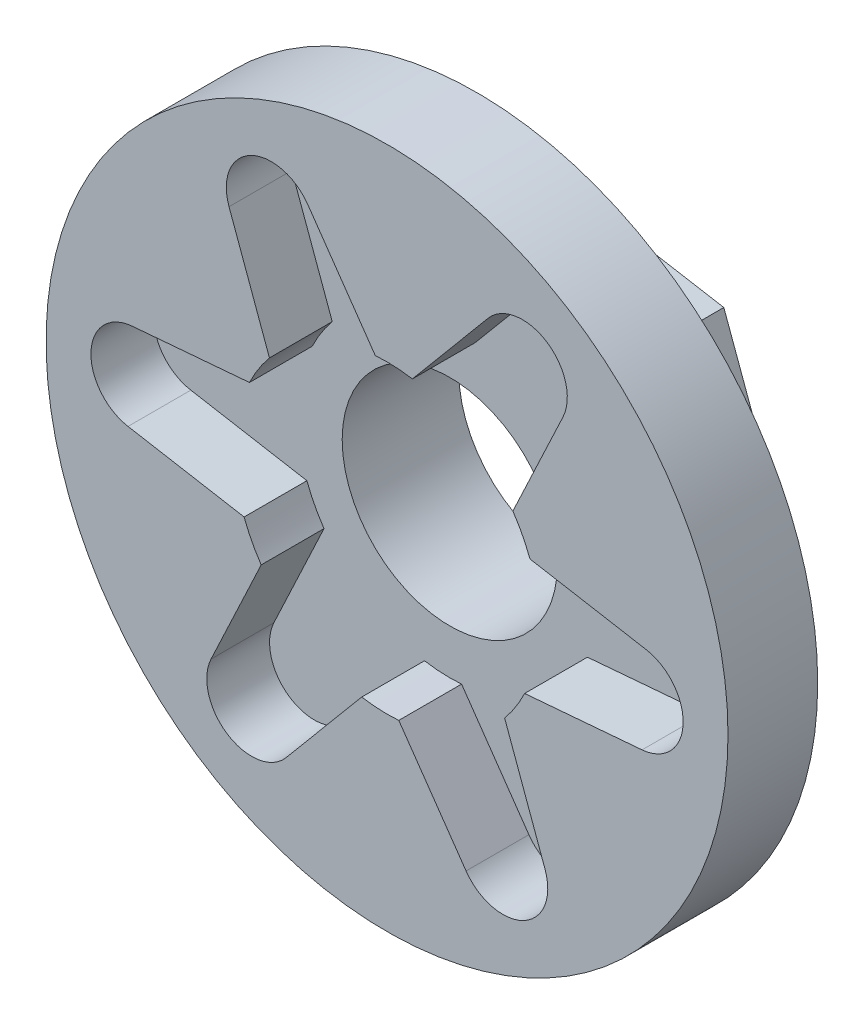
ISO-10303-21;
HEADER;
FILE_DESCRIPTION(('STEP AP214'),'2;1');
FILE_NAME('part.step','',(''),(''),'','','');
FILE_SCHEMA(('AUTOMOTIVE_DESIGN { 1 0 10303 214 1 1 1 1 }'));
ENDSEC;
DATA;
#1=APPLICATION_CONTEXT('core data for automotive mechanical design processes');
#2=APPLICATION_PROTOCOL_DEFINITION('international standard','automotive_design',2000,#1);
#3=PRODUCT_CONTEXT('',#1,'mechanical');
#4=PRODUCT('Part','Part','',(#3));
#5=PRODUCT_RELATED_PRODUCT_CATEGORY('part','',(#4));
#6=PRODUCT_DEFINITION_FORMATION('','',#4);
#7=PRODUCT_DEFINITION_CONTEXT('part definition',#1,'design');
#8=PRODUCT_DEFINITION('design','',#6,#7);
#9=PRODUCT_DEFINITION_SHAPE('','',#8);
#10=(LENGTH_UNIT() NAMED_UNIT(*) SI_UNIT(.MILLI.,.METRE.));
#11=(NAMED_UNIT(*) PLANE_ANGLE_UNIT() SI_UNIT($,.RADIAN.));
#12=(NAMED_UNIT(*) SI_UNIT($,.STERADIAN.) SOLID_ANGLE_UNIT());
#13=UNCERTAINTY_MEASURE_WITH_UNIT(LENGTH_MEASURE(1.E-05),#10,'distance_accuracy_value','');
#14=(GEOMETRIC_REPRESENTATION_CONTEXT(3) GLOBAL_UNCERTAINTY_ASSIGNED_CONTEXT((#13)) GLOBAL_UNIT_ASSIGNED_CONTEXT((#10,
#11,#12)) REPRESENTATION_CONTEXT('',''));
#15=CARTESIAN_POINT('',(0.,0.,0.));
#16=DIRECTION('',(0.,0.,1.));
#17=DIRECTION('',(1.,0.,0.));
#18=AXIS2_PLACEMENT_3D('',#15,#16,#17);
#19=CARTESIAN_POINT('',(13.4818504720309,-2.33874065466868,5.));
#20=DIRECTION('',(-0.938741963200543,-0.344620844590674,0.));
#21=DIRECTION('',(0.344620844590674,-0.938741963200543,0.));
#22=AXIS2_PLACEMENT_3D('',#19,#20,#21);
#23=PLANE('',#22);
#24=DIRECTION('',(-0.344620844590674,0.938741963200543,0.));
#25=VECTOR('',#24,1.);
#26=CARTESIAN_POINT('',(13.4818504720309,-2.33874065466868,0.));
#27=LINE('',#26,#25);
#28=CARTESIAN_POINT('',(13.4818504720309,-2.33874065466868,0.));
#29=VERTEX_POINT('',#28);
#30=CARTESIAN_POINT('',(8.76633405582198,10.5062546714676,0.));
#31=VERTEX_POINT('',#30);
#32=EDGE_CURVE('E133',#29,#31,#27,.T.);
#33=ORIENTED_EDGE('',*,*,#32,.T.);
#34=DIRECTION('',(0.,0.,-1.));
#35=VECTOR('',#34,1.);
#36=CARTESIAN_POINT('',(8.76633405582198,10.5062546714676,5.));
#37=LINE('',#36,#35);
#38=CARTESIAN_POINT('',(8.76633405582198,10.5062546714676,5.));
#39=VERTEX_POINT('',#38);
#40=EDGE_CURVE('E11',#39,#31,#37,.T.);
#41=ORIENTED_EDGE('',*,*,#40,.F.);
#42=DIRECTION('',(-0.344620844590674,0.938741963200543,0.));
#43=VECTOR('',#42,1.);
#44=CARTESIAN_POINT('',(13.4818504720309,-2.33874065466868,5.));
#45=LINE('',#44,#43);
#46=CARTESIAN_POINT('',(13.4818504720309,-2.33874065466868,5.));
#47=VERTEX_POINT('',#46);
#48=EDGE_CURVE('E125',#47,#39,#45,.T.);
#49=ORIENTED_EDGE('',*,*,#48,.F.);
#50=DIRECTION('',(0.,0.,-1.));
#51=VECTOR('',#50,1.);
#52=CARTESIAN_POINT('',(13.4818504720309,-2.33874065466868,5.));
#53=LINE('',#52,#51);
#54=EDGE_CURVE('E132',#47,#29,#53,.T.);
#55=ORIENTED_EDGE('',*,*,#54,.T.);
#56=EDGE_LOOP('',(#33,#41,#49,#55));
#57=FACE_BOUND('',#56,.T.);
#58=ADVANCED_FACE('F33',(#57),#23,.F.);
#59=CARTESIAN_POINT('',(8.76633405582198,10.5062546714676,5.));
#60=DIRECTION('',(-0.170920575511099,-0.985284810025484,0.));
#61=DIRECTION('',(0.985284810025484,-0.170920575511099,0.));
#62=AXIS2_PLACEMENT_3D('',#59,#60,#61);
#63=PLANE('',#62);
#64=DIRECTION('',(-0.985284810025484,0.170920575511099,0.));
#65=VECTOR('',#64,1.);
#66=CARTESIAN_POINT('',(8.76633405582198,10.5062546714676,0.));
#67=LINE('',#66,#65);
#68=CARTESIAN_POINT('',(-4.71551641620892,12.8449953261363,0.));
#69=VERTEX_POINT('',#68);
#70=EDGE_CURVE('E136',#31,#69,#67,.T.);
#71=ORIENTED_EDGE('',*,*,#70,.T.);
#72=DIRECTION('',(0.,0.,-1.));
#73=VECTOR('',#72,1.);
#74=CARTESIAN_POINT('',(-4.71551641620892,12.8449953261363,5.));
#75=LINE('',#74,#73);
#76=CARTESIAN_POINT('',(-4.71551641620892,12.8449953261363,5.));
#77=VERTEX_POINT('',#76);
#78=EDGE_CURVE('E41',#77,#69,#75,.T.);
#79=ORIENTED_EDGE('',*,*,#78,.F.);
#80=DIRECTION('',(-0.985284810025484,0.170920575511099,0.));
#81=VECTOR('',#80,1.);
#82=CARTESIAN_POINT('',(8.76633405582198,10.5062546714676,5.));
#83=LINE('',#82,#81);
#84=EDGE_CURVE('E92',#39,#77,#83,.T.);
#85=ORIENTED_EDGE('',*,*,#84,.F.);
#86=ORIENTED_EDGE('',*,*,#40,.T.);
#87=EDGE_LOOP('',(#71,#79,#85,#86));
#88=FACE_BOUND('',#87,.T.);
#89=ADVANCED_FACE('F609',(#88),#63,.F.);
#90=CARTESIAN_POINT('',(-4.71551641620892,12.8449953261363,5.));
#91=DIRECTION('',(0.767821387689445,-0.64066396543481,0.));
#92=DIRECTION('',(0.64066396543481,0.767821387689445,0.));
#93=AXIS2_PLACEMENT_3D('',#90,#91,#92);
#94=PLANE('',#93);
#95=DIRECTION('',(-0.64066396543481,-0.767821387689445,0.));
#96=VECTOR('',#95,1.);
#97=CARTESIAN_POINT('',(-4.71551641620892,12.8449953261363,0.));
#98=LINE('',#97,#96);
#99=CARTESIAN_POINT('',(-13.4818504720309,2.33874065466867,0.));
#100=VERTEX_POINT('',#99);
#101=EDGE_CURVE('E108',#69,#100,#98,.T.);
#102=ORIENTED_EDGE('',*,*,#101,.T.);
#103=DIRECTION('',(0.,0.,-1.));
#104=VECTOR('',#103,1.);
#105=CARTESIAN_POINT('',(-13.4818504720309,2.33874065466867,5.));
#106=LINE('',#105,#104);
#107=CARTESIAN_POINT('',(-13.4818504720309,2.33874065466867,5.));
#108=VERTEX_POINT('',#107);
#109=EDGE_CURVE('E101',#108,#100,#106,.T.);
#110=ORIENTED_EDGE('',*,*,#109,.F.);
#111=DIRECTION('',(-0.64066396543481,-0.767821387689445,0.));
#112=VECTOR('',#111,1.);
#113=CARTESIAN_POINT('',(-4.71551641620892,12.8449953261363,5.));
#114=LINE('',#113,#112);
#115=EDGE_CURVE('E106',#77,#108,#114,.T.);
#116=ORIENTED_EDGE('',*,*,#115,.F.);
#117=ORIENTED_EDGE('',*,*,#78,.T.);
#118=EDGE_LOOP('',(#102,#110,#116,#117));
#119=FACE_BOUND('',#118,.T.);
#120=ADVANCED_FACE('F103',(#119),#94,.F.);
#121=CARTESIAN_POINT('',(-13.4818504720309,2.33874065466867,5.));
#122=DIRECTION('',(0.938741963200544,0.344620844590674,0.));
#123=DIRECTION('',(-0.344620844590674,0.938741963200544,0.));
#124=AXIS2_PLACEMENT_3D('',#121,#122,#123);
#125=PLANE('',#124);
#126=DIRECTION('',(0.344620844590674,-0.938741963200544,0.));
#127=VECTOR('',#126,1.);
#128=CARTESIAN_POINT('',(-13.4818504720309,2.33874065466867,0.));
#129=LINE('',#128,#127);
#130=CARTESIAN_POINT('',(-8.76633405582197,-10.5062546714676,0.));
#131=VERTEX_POINT('',#130);
#132=EDGE_CURVE('E140',#100,#131,#129,.T.);
#133=ORIENTED_EDGE('',*,*,#132,.T.);
#134=DIRECTION('',(0.,0.,-1.));
#135=VECTOR('',#134,1.);
#136=CARTESIAN_POINT('',(-8.76633405582197,-10.5062546714676,5.));
#137=LINE('',#136,#135);
#138=CARTESIAN_POINT('',(-8.76633405582197,-10.5062546714676,5.));
#139=VERTEX_POINT('',#138);
#140=EDGE_CURVE('E111',#139,#131,#137,.T.);
#141=ORIENTED_EDGE('',*,*,#140,.F.);
#142=DIRECTION('',(0.344620844590674,-0.938741963200544,0.));
#143=VECTOR('',#142,1.);
#144=CARTESIAN_POINT('',(-13.4818504720309,2.33874065466867,5.));
#145=LINE('',#144,#143);
#146=EDGE_CURVE('E114',#108,#139,#145,.T.);
#147=ORIENTED_EDGE('',*,*,#146,.F.);
#148=ORIENTED_EDGE('',*,*,#109,.T.);
#149=EDGE_LOOP('',(#133,#141,#147,#148));
#150=FACE_BOUND('',#149,.T.);
#151=ADVANCED_FACE('F115',(#150),#125,.F.);
#152=CARTESIAN_POINT('',(-8.76633405582197,-10.5062546714676,5.));
#153=DIRECTION('',(0.170920575511099,0.985284810025484,0.));
#154=DIRECTION('',(-0.985284810025485,0.170920575511099,0.));
#155=AXIS2_PLACEMENT_3D('',#152,#153,#154);
#156=PLANE('',#155);
#157=DIRECTION('',(0.985284810025484,-0.170920575511099,0.));
#158=VECTOR('',#157,1.);
#159=CARTESIAN_POINT('',(-8.76633405582197,-10.5062546714676,0.));
#160=LINE('',#159,#158);
#161=CARTESIAN_POINT('',(4.71551641620893,-12.8449953261363,0.));
#162=VERTEX_POINT('',#161);
#163=EDGE_CURVE('E142',#131,#162,#160,.T.);
#164=ORIENTED_EDGE('',*,*,#163,.T.);
#165=DIRECTION('',(0.,0.,-1.));
#166=VECTOR('',#165,1.);
#167=CARTESIAN_POINT('',(4.71551641620893,-12.8449953261363,5.));
#168=LINE('',#167,#166);
#169=CARTESIAN_POINT('',(4.71551641620893,-12.8449953261363,5.));
#170=VERTEX_POINT('',#169);
#171=EDGE_CURVE('E57',#170,#162,#168,.T.);
#172=ORIENTED_EDGE('',*,*,#171,.F.);
#173=DIRECTION('',(0.985284810025484,-0.170920575511099,0.));
#174=VECTOR('',#173,1.);
#175=CARTESIAN_POINT('',(-8.76633405582197,-10.5062546714676,5.));
#176=LINE('',#175,#174);
#177=EDGE_CURVE('E119',#139,#170,#176,.T.);
#178=ORIENTED_EDGE('',*,*,#177,.F.);
#179=ORIENTED_EDGE('',*,*,#140,.T.);
#180=EDGE_LOOP('',(#164,#172,#178,#179));
#181=FACE_BOUND('',#180,.T.);
#182=ADVANCED_FACE('F152',(#181),#156,.F.);
#183=CARTESIAN_POINT('',(4.71551641620893,-12.8449953261363,5.));
#184=DIRECTION('',(-0.767821387689445,0.64066396543481,0.));
#185=DIRECTION('',(-0.64066396543481,-0.767821387689445,0.));
#186=AXIS2_PLACEMENT_3D('',#183,#184,#185);
#187=PLANE('',#186);
#188=DIRECTION('',(0.64066396543481,0.767821387689445,0.));
#189=VECTOR('',#188,1.);
#190=CARTESIAN_POINT('',(4.71551641620893,-12.8449953261363,0.));
#191=LINE('',#190,#189);
#192=EDGE_CURVE('E84',#162,#29,#191,.T.);
#193=ORIENTED_EDGE('',*,*,#192,.T.);
#194=ORIENTED_EDGE('',*,*,#54,.F.);
#195=DIRECTION('',(0.64066396543481,0.767821387689445,0.));
#196=VECTOR('',#195,1.);
#197=CARTESIAN_POINT('',(4.71551641620893,-12.8449953261363,5.));
#198=LINE('',#197,#196);
#199=EDGE_CURVE('E130',#170,#47,#198,.T.);
#200=ORIENTED_EDGE('',*,*,#199,.F.);
#201=ORIENTED_EDGE('',*,*,#171,.T.);
#202=EDGE_LOOP('',(#193,#194,#200,#201));
#203=FACE_BOUND('',#202,.T.);
#204=ADVANCED_FACE('F155',(#203),#187,.F.);
#205=CARTESIAN_POINT('',(0.,0.,0.));
#206=DIRECTION('',(0.,0.,1.));
#207=DIRECTION('',(1.,0.,0.));
#208=AXIS2_PLACEMENT_3D('',#205,#206,#207);
#209=PLANE('',#208);
#210=CARTESIAN_POINT('',(0.,0.,0.));
#211=DIRECTION('',(0.,0.,-1.));
#212=DIRECTION('',(-1.,0.,0.));
#213=AXIS2_PLACEMENT_3D('',#210,#211,#212);
#214=CIRCLE('',#213,6.);
#215=CARTESIAN_POINT('',(-6.,0.,0.));
#216=VERTEX_POINT('',#215);
#217=EDGE_CURVE('E375',#216,#216,#214,.T.);
#218=ORIENTED_EDGE('',*,*,#217,.F.);
#219=EDGE_LOOP('',(#218));
#220=FACE_BOUND('',#219,.T.);
#221=ORIENTED_EDGE('',*,*,#32,.F.);
#222=ORIENTED_EDGE('',*,*,#192,.F.);
#223=ORIENTED_EDGE('',*,*,#163,.F.);
#224=ORIENTED_EDGE('',*,*,#132,.F.);
#225=ORIENTED_EDGE('',*,*,#101,.F.);
#226=ORIENTED_EDGE('',*,*,#70,.F.);
#227=EDGE_LOOP('',(#221,#222,#223,#224,#225,#226));
#228=FACE_BOUND('',#227,.T.);
#229=ADVANCED_FACE('F150',(#220,#228),#209,.F.);
#230=CARTESIAN_POINT('',(0.,0.,5.));
#231=DIRECTION('',(0.,0.,1.));
#232=DIRECTION('',(1.,0.,0.));
#233=AXIS2_PLACEMENT_3D('',#230,#231,#232);
#234=PLANE('',#233);
#235=CARTESIAN_POINT('',(0.,0.,5.));
#236=DIRECTION('',(0.,0.,1.));
#237=DIRECTION('',(1.,0.,0.));
#238=AXIS2_PLACEMENT_3D('',#235,#236,#237);
#239=CIRCLE('',#238,19.);
#240=CARTESIAN_POINT('',(19.,0.,5.));
#241=VERTEX_POINT('',#240);
#242=EDGE_CURVE('E158',#241,#241,#239,.T.);
#243=ORIENTED_EDGE('',*,*,#242,.F.);
#244=EDGE_LOOP('',(#243));
#245=FACE_BOUND('',#244,.T.);
#246=ORIENTED_EDGE('',*,*,#199,.T.);
#247=ORIENTED_EDGE('',*,*,#48,.T.);
#248=ORIENTED_EDGE('',*,*,#84,.T.);
#249=ORIENTED_EDGE('',*,*,#115,.T.);
#250=ORIENTED_EDGE('',*,*,#146,.T.);
#251=ORIENTED_EDGE('',*,*,#177,.T.);
#252=EDGE_LOOP('',(#246,#247,#248,#249,#250,#251));
#253=FACE_BOUND('',#252,.T.);
#254=ADVANCED_FACE('F122',(#245,#253),#234,.F.);
#255=CARTESIAN_POINT('',(0.,0.,10.));
#256=DIRECTION('',(0.,0.,-1.));
#257=DIRECTION('',(-1.,0.,0.));
#258=AXIS2_PLACEMENT_3D('',#255,#256,#257);
#259=CYLINDRICAL_SURFACE('',#258,19.);
#260=CARTESIAN_POINT('',(0.,0.,10.));
#261=DIRECTION('',(0.,0.,1.));
#262=DIRECTION('',(1.,0.,0.));
#263=AXIS2_PLACEMENT_3D('',#260,#261,#262);
#264=CIRCLE('',#263,19.);
#265=CARTESIAN_POINT('',(19.,0.,10.));
#266=VERTEX_POINT('',#265);
#267=EDGE_CURVE('E137',#266,#266,#264,.T.);
#268=ORIENTED_EDGE('',*,*,#267,.F.);
#269=EDGE_LOOP('',(#268));
#270=FACE_BOUND('',#269,.T.);
#271=ORIENTED_EDGE('',*,*,#242,.T.);
#272=EDGE_LOOP('',(#271));
#273=FACE_BOUND('',#272,.T.);
#274=ADVANCED_FACE('F627',(#270,#273),#259,.T.);
#275=CARTESIAN_POINT('',(0.,0.,10.));
#276=DIRECTION('',(0.,0.,1.));
#277=DIRECTION('',(1.,0.,0.));
#278=AXIS2_PLACEMENT_3D('',#275,#276,#277);
#279=PLANE('',#278);
#280=CARTESIAN_POINT('',(0.,0.,10.));
#281=DIRECTION('',(0.,0.,1.));
#282=DIRECTION('',(1.,0.,0.));
#283=AXIS2_PLACEMENT_3D('',#280,#281,#282);
#284=CIRCLE('',#283,8.5);
#285=CARTESIAN_POINT('',(6.55312688460915,-5.41355040931668,10.));
#286=VERTEX_POINT('',#285);
#287=CARTESIAN_POINT('',(7.66666654621537,-3.67045284251714,10.));
#288=VERTEX_POINT('',#287);
#289=EDGE_CURVE('E48',#286,#288,#284,.T.);
#290=ORIENTED_EDGE('',*,*,#289,.F.);
#291=DIRECTION('',(-0.342838106847411,0.939394503120645,0.));
#292=VECTOR('',#291,1.);
#293=CARTESIAN_POINT('',(4.03939636341952,1.47420385944414,10.));
#294=LINE('',#293,#292);
#295=CARTESIAN_POINT('',(8.80484604859892,-11.5833797339326,10.));
#296=VERTEX_POINT('',#295);
#297=EDGE_CURVE('E234',#296,#286,#294,.T.);
#298=ORIENTED_EDGE('',*,*,#297,.F.);
#299=CARTESIAN_POINT('',(6.45635979079689,-12.4404750010513,10.));
#300=DIRECTION('',(0.,0.,1.));
#301=DIRECTION('',(1.,0.,0.));
#302=AXIS2_PLACEMENT_3D('',#299,#300,#301);
#303=CIRCLE('',#302,2.50000000000089);
#304=CARTESIAN_POINT('',(4.40365993216602,-13.8675080386433,10.));
#305=VERTEX_POINT('',#304);
#306=EDGE_CURVE('E238',#305,#296,#303,.T.);
#307=ORIENTED_EDGE('',*,*,#306,.F.);
#308=DIRECTION('',(0.5708132150367,-0.821079943452199,0.));
#309=VECTOR('',#308,1.);
#310=CARTESIAN_POINT('',(-3.5306437568438,-2.45449682465735,10.));
#311=LINE('',#310,#309);
#312=CARTESIAN_POINT('',(0.654627868095318,-8.47475441262536,10.));
#313=VERTEX_POINT('',#312);
#314=EDGE_CURVE('E241',#313,#305,#311,.T.);
#315=ORIENTED_EDGE('',*,*,#314,.F.);
#316=CARTESIAN_POINT('',(0.,0.,10.));
#317=DIRECTION('',(0.,0.,1.));
#318=DIRECTION('',(1.,0.,0.));
#319=AXIS2_PLACEMENT_3D('',#316,#317,#318);
#320=CIRCLE('',#319,8.5);
#321=CARTESIAN_POINT('',(-1.41170873683159,-8.38194956095259,10.));
#322=VERTEX_POINT('',#321);
#323=EDGE_CURVE('E244',#322,#313,#320,.T.);
#324=ORIENTED_EDGE('',*,*,#323,.F.);
#325=DIRECTION('',(0.642120450454233,0.766603761475544,0.));
#326=VECTOR('',#325,1.);
#327=CARTESIAN_POINT('',(3.29639617434527,-2.76111793695356,10.));
#328=LINE('',#327,#326);
#329=CARTESIAN_POINT('',(-5.62907808696805,-13.4169102214635,10.));
#330=VERTEX_POINT('',#329);
#331=EDGE_CURVE('E247',#330,#322,#328,.T.);
#332=ORIENTED_EDGE('',*,*,#331,.F.);
#333=CARTESIAN_POINT('',(-7.54558749065716,-11.8116090953277,10.));
#334=DIRECTION('',(0.,0.,1.));
#335=DIRECTION('',(1.,0.,0.));
#336=AXIS2_PLACEMENT_3D('',#333,#334,#335);
#337=CIRCLE('',#336,2.50000000000067);
#338=CARTESIAN_POINT('',(-9.80778428256684,-10.7474353902047,10.));
#339=VERTEX_POINT('',#338);
#340=EDGE_CURVE('E250',#339,#330,#337,.T.);
#341=ORIENTED_EDGE('',*,*,#340,.F.);
#342=DIRECTION('',(-0.425669482049144,-0.904878716763751,0.));
#343=VECTOR('',#342,1.);
#344=CARTESIAN_POINT('',(-3.89097848208355,1.83037877281105,10.));
#345=LINE('',#344,#343);
#346=CARTESIAN_POINT('',(-7.01203867812027,-4.80430157010833,10.));
#347=VERTEX_POINT('',#346);
#348=EDGE_CURVE('E253',#347,#339,#345,.T.);
#349=ORIENTED_EDGE('',*,*,#348,.F.);
#350=CARTESIAN_POINT('',(0.,0.,10.));
#351=DIRECTION('',(0.,0.,1.));
#352=DIRECTION('',(1.,0.,0.));
#353=AXIS2_PLACEMENT_3D('',#350,#351,#352);
#354=CIRCLE('',#353,8.5);
#355=CARTESIAN_POINT('',(-7.96483562144072,-2.96839915163527,10.));
#356=VERTEX_POINT('',#355);
#357=EDGE_CURVE('E256',#356,#347,#354,.T.);
#358=ORIENTED_EDGE('',*,*,#357,.F.);
#359=DIRECTION('',(0.984958557301644,-0.172790741645101,0.));
#360=VECTOR('',#359,1.);
#361=CARTESIAN_POINT('',(-0.743000189073959,-4.23532179639722,10.));
#362=LINE('',#361,#360);
#363=CARTESIAN_POINT('',(-14.4339241355665,-1.83353048753054,10.));
#364=VERTEX_POINT('',#363);
#365=EDGE_CURVE('E259',#364,#356,#362,.T.);
#366=ORIENTED_EDGE('',*,*,#365,.F.);
#367=CARTESIAN_POINT('',(-14.0019472814537,0.62886590572372,10.));
#368=DIRECTION('',(0.,0.,1.));
#369=DIRECTION('',(1.,0.,0.));
#370=AXIS2_PLACEMENT_3D('',#367,#368,#369);
#371=CIRCLE('',#370,2.50000000000031);
#372=CARTESIAN_POINT('',(-14.2114442147326,3.12007264843849,10.));
#373=VERTEX_POINT('',#372);
#374=EDGE_CURVE('E262',#373,#364,#371,.T.);
#375=ORIENTED_EDGE('',*,*,#374,.F.);
#376=DIRECTION('',(-0.996482697085843,-0.0837987733115704,0.));
#377=VECTOR('',#376,1.);
#378=CARTESIAN_POINT('',(-0.360334725239753,4.28487559746913,10.));
#379=LINE('',#378,#377);
#380=CARTESIAN_POINT('',(-7.66666654621516,3.67045284251758,10.));
#381=VERTEX_POINT('',#380);
#382=EDGE_CURVE('E265',#381,#373,#379,.T.);
#383=ORIENTED_EDGE('',*,*,#382,.F.);
#384=CARTESIAN_POINT('',(0.,0.,10.));
#385=DIRECTION('',(0.,0.,1.));
#386=DIRECTION('',(1.,0.,0.));
#387=AXIS2_PLACEMENT_3D('',#384,#385,#386);
#388=CIRCLE('',#387,8.5);
#389=CARTESIAN_POINT('',(-6.55312688460856,5.41355040931739,10.));
#390=VERTEX_POINT('',#389);
#391=EDGE_CURVE('E268',#390,#381,#388,.T.);
#392=ORIENTED_EDGE('',*,*,#391,.F.);
#393=DIRECTION('',(0.342838106847411,-0.939394503120645,0.));
#394=VECTOR('',#393,1.);
#395=CARTESIAN_POINT('',(-4.03939636341877,-1.47420385944387,10.));
#396=LINE('',#395,#394);
#397=CARTESIAN_POINT('',(-8.80484604859778,11.5833797339331,10.));
#398=VERTEX_POINT('',#397);
#399=EDGE_CURVE('E271',#398,#390,#396,.T.);
#400=ORIENTED_EDGE('',*,*,#399,.F.);
#401=CARTESIAN_POINT('',(-6.45635979079617,12.4404750010516,10.));
#402=DIRECTION('',(0.,0.,1.));
#403=DIRECTION('',(1.,0.,0.));
#404=AXIS2_PLACEMENT_3D('',#401,#402,#403);
#405=CIRCLE('',#404,2.5);
#406=CARTESIAN_POINT('',(-4.40365993216567,13.8675080386434,10.));
#407=VERTEX_POINT('',#406);
#408=EDGE_CURVE('E274',#407,#398,#405,.T.);
#409=ORIENTED_EDGE('',*,*,#408,.F.);
#410=DIRECTION('',(-0.5708132150367,0.821079943452199,0.));
#411=VECTOR('',#410,1.);
#412=CARTESIAN_POINT('',(3.53064375684446,2.45449682465781,10.));
#413=LINE('',#412,#411);
#414=CARTESIAN_POINT('',(-0.654627868094393,8.47475441262543,10.));
#415=VERTEX_POINT('',#414);
#416=EDGE_CURVE('E277',#415,#407,#413,.T.);
#417=ORIENTED_EDGE('',*,*,#416,.F.);
#418=CARTESIAN_POINT('',(0.,0.,10.));
#419=DIRECTION('',(0.,0.,1.));
#420=DIRECTION('',(1.,0.,0.));
#421=AXIS2_PLACEMENT_3D('',#418,#419,#420);
#422=CIRCLE('',#421,8.5);
#423=CARTESIAN_POINT('',(1.41170873683224,8.38194956095248,10.));
#424=VERTEX_POINT('',#423);
#425=EDGE_CURVE('E280',#424,#415,#422,.T.);
#426=ORIENTED_EDGE('',*,*,#425,.F.);
#427=DIRECTION('',(-0.642120450454235,-0.766603761475542,0.));
#428=VECTOR('',#427,1.);
#429=CARTESIAN_POINT('',(-3.29639617434483,2.76111793695321,10.));
#430=LINE('',#429,#428);
#431=CARTESIAN_POINT('',(5.62907808696904,13.4169102214633,10.));
#432=VERTEX_POINT('',#431);
#433=EDGE_CURVE('E283',#432,#424,#430,.T.);
#434=ORIENTED_EDGE('',*,*,#433,.F.);
#435=CARTESIAN_POINT('',(7.5455874906579,11.8116090953277,10.));
#436=DIRECTION('',(0.,0.,1.));
#437=DIRECTION('',(1.,0.,0.));
#438=AXIS2_PLACEMENT_3D('',#435,#436,#437);
#439=CIRCLE('',#438,2.5);
#440=CARTESIAN_POINT('',(9.80778428256727,10.7474353902048,10.));
#441=VERTEX_POINT('',#440);
#442=EDGE_CURVE('E286',#441,#432,#439,.T.);
#443=ORIENTED_EDGE('',*,*,#442,.F.);
#444=DIRECTION('',(0.425669482049147,0.90487871676375,0.));
#445=VECTOR('',#444,1.);
#446=CARTESIAN_POINT('',(3.89097848208413,-1.83037877281133,10.));
#447=LINE('',#446,#445);
#448=CARTESIAN_POINT('',(7.01203867812071,4.80430157010769,10.));
#449=VERTEX_POINT('',#448);
#450=EDGE_CURVE('E289',#449,#441,#447,.T.);
#451=ORIENTED_EDGE('',*,*,#450,.F.);
#452=CARTESIAN_POINT('',(0.,0.,10.));
#453=DIRECTION('',(0.,0.,1.));
#454=DIRECTION('',(1.,0.,0.));
#455=AXIS2_PLACEMENT_3D('',#452,#453,#454);
#456=CIRCLE('',#455,8.5);
#457=CARTESIAN_POINT('',(7.96483562144053,2.9683991516358,10.));
#458=VERTEX_POINT('',#457);
#459=EDGE_CURVE('E292',#458,#449,#456,.T.);
#460=ORIENTED_EDGE('',*,*,#459,.F.);
#461=DIRECTION('',(-0.984958557301644,0.172790741645101,0.));
#462=VECTOR('',#461,1.);
#463=CARTESIAN_POINT('',(0.743000189074046,4.2353217963977,10.));
#464=LINE('',#463,#462);
#465=CARTESIAN_POINT('',(14.4339241355672,1.83353048753111,10.));
#466=VERTEX_POINT('',#465);
#467=EDGE_CURVE('E295',#466,#458,#464,.T.);
#468=ORIENTED_EDGE('',*,*,#467,.F.);
#469=CARTESIAN_POINT('',(14.0019472814544,-0.628865905723361,10.));
#470=DIRECTION('',(0.,0.,1.));
#471=DIRECTION('',(1.,0.,0.));
#472=AXIS2_PLACEMENT_3D('',#469,#470,#471);
#473=CIRCLE('',#472,2.50000000000072);
#474=CARTESIAN_POINT('',(14.2114442147333,-3.12007264843833,10.));
#475=VERTEX_POINT('',#474);
#476=EDGE_CURVE('E298',#475,#466,#473,.T.);
#477=ORIENTED_EDGE('',*,*,#476,.F.);
#478=DIRECTION('',(0.996482697085845,0.0837987733115522,0.));
#479=VECTOR('',#478,1.);
#480=CARTESIAN_POINT('',(0.360334725239628,-4.28487559746858,10.));
#481=LINE('',#480,#479);
#482=EDGE_CURVE('E301',#288,#475,#481,.T.);
#483=ORIENTED_EDGE('',*,*,#482,.F.);
#484=EDGE_LOOP('',(#290,#298,#307,#315,#324,#332,#341,#349,#358,#366,#375,#383,#392,#400,#409,
#417,#426,#434,#443,#451,#460,#468,#477,#483));
#485=FACE_BOUND('',#484,.T.);
#486=ORIENTED_EDGE('',*,*,#267,.T.);
#487=EDGE_LOOP('',(#486));
#488=FACE_BOUND('',#487,.T.);
#489=ADVANCED_FACE('F458',(#485,#488),#279,.T.);
#490=CARTESIAN_POINT('',(0.,0.,6.5));
#491=DIRECTION('',(0.,0.,1.));
#492=DIRECTION('',(1.,0.,0.));
#493=AXIS2_PLACEMENT_3D('',#490,#491,#492);
#494=CYLINDRICAL_SURFACE('',#493,8.5);
#495=ORIENTED_EDGE('',*,*,#289,.T.);
#496=DIRECTION('',(0.,0.,1.));
#497=VECTOR('',#496,1.);
#498=CARTESIAN_POINT('',(7.66666654621537,-3.67045284251714,6.5));
#499=LINE('',#498,#497);
#500=CARTESIAN_POINT('',(7.66666654621537,-3.67045284251714,6.5));
#501=VERTEX_POINT('',#500);
#502=EDGE_CURVE('E164',#501,#288,#499,.T.);
#503=ORIENTED_EDGE('',*,*,#502,.F.);
#504=CARTESIAN_POINT('',(0.,0.,6.5));
#505=DIRECTION('',(0.,0.,1.));
#506=DIRECTION('',(1.,0.,0.));
#507=AXIS2_PLACEMENT_3D('',#504,#505,#506);
#508=CIRCLE('',#507,8.5);
#509=CARTESIAN_POINT('',(6.55312688460915,-5.41355040931668,6.5));
#510=VERTEX_POINT('',#509);
#511=EDGE_CURVE('E237',#510,#501,#508,.T.);
#512=ORIENTED_EDGE('',*,*,#511,.F.);
#513=DIRECTION('',(0.,0.,1.));
#514=VECTOR('',#513,1.);
#515=CARTESIAN_POINT('',(6.55312688460915,-5.41355040931668,6.5));
#516=LINE('',#515,#514);
#517=EDGE_CURVE('E161',#510,#286,#516,.T.);
#518=ORIENTED_EDGE('',*,*,#517,.T.);
#519=EDGE_LOOP('',(#495,#503,#512,#518));
#520=FACE_BOUND('',#519,.T.);
#521=ADVANCED_FACE('F396',(#520),#494,.F.);
#522=CARTESIAN_POINT('',(4.03939636341952,1.47420385944414,6.5));
#523=DIRECTION('',(0.939394503120645,0.342838106847411,0.));
#524=DIRECTION('',(-0.342838106847411,0.939394503120645,0.));
#525=AXIS2_PLACEMENT_3D('',#522,#523,#524);
#526=PLANE('',#525);
#527=ORIENTED_EDGE('',*,*,#297,.T.);
#528=ORIENTED_EDGE('',*,*,#517,.F.);
#529=DIRECTION('',(-0.342838106847411,0.939394503120645,0.));
#530=VECTOR('',#529,1.);
#531=CARTESIAN_POINT('',(4.03939636341952,1.47420385944414,6.5));
#532=LINE('',#531,#530);
#533=CARTESIAN_POINT('',(8.80484604859892,-11.5833797339326,6.5));
#534=VERTEX_POINT('',#533);
#535=EDGE_CURVE('E167',#534,#510,#532,.T.);
#536=ORIENTED_EDGE('',*,*,#535,.F.);
#537=DIRECTION('',(0.,0.,1.));
#538=VECTOR('',#537,1.);
#539=CARTESIAN_POINT('',(8.80484604859892,-11.5833797339326,6.5));
#540=LINE('',#539,#538);
#541=EDGE_CURVE('E230',#534,#296,#540,.T.);
#542=ORIENTED_EDGE('',*,*,#541,.T.);
#543=EDGE_LOOP('',(#527,#528,#536,#542));
#544=FACE_BOUND('',#543,.T.);
#545=ADVANCED_FACE('F449',(#544),#526,.F.);
#546=CARTESIAN_POINT('',(6.45635979079689,-12.4404750010513,6.5));
#547=DIRECTION('',(0.,0.,1.));
#548=DIRECTION('',(1.,0.,0.));
#549=AXIS2_PLACEMENT_3D('',#546,#547,#548);
#550=CYLINDRICAL_SURFACE('',#549,2.50000000000089);
#551=ORIENTED_EDGE('',*,*,#306,.T.);
#552=ORIENTED_EDGE('',*,*,#541,.F.);
#553=CARTESIAN_POINT('',(6.45635979079689,-12.4404750010513,6.5));
#554=DIRECTION('',(0.,0.,1.));
#555=DIRECTION('',(1.,0.,0.));
#556=AXIS2_PLACEMENT_3D('',#553,#554,#555);
#557=CIRCLE('',#556,2.50000000000089);
#558=CARTESIAN_POINT('',(4.40365993216602,-13.8675080386433,6.5));
#559=VERTEX_POINT('',#558);
#560=EDGE_CURVE('E307',#559,#534,#557,.T.);
#561=ORIENTED_EDGE('',*,*,#560,.F.);
#562=DIRECTION('',(0.,0.,1.));
#563=VECTOR('',#562,1.);
#564=CARTESIAN_POINT('',(4.40365993216602,-13.8675080386433,6.5));
#565=LINE('',#564,#563);
#566=EDGE_CURVE('E227',#559,#305,#565,.T.);
#567=ORIENTED_EDGE('',*,*,#566,.T.);
#568=EDGE_LOOP('',(#551,#552,#561,#567));
#569=FACE_BOUND('',#568,.T.);
#570=ADVANCED_FACE('F454',(#569),#550,.F.);
#571=CARTESIAN_POINT('',(-3.5306437568438,-2.45449682465735,6.5));
#572=DIRECTION('',(-0.821079943452199,-0.5708132150367,0.));
#573=DIRECTION('',(0.5708132150367,-0.821079943452199,0.));
#574=AXIS2_PLACEMENT_3D('',#571,#572,#573);
#575=PLANE('',#574);
#576=ORIENTED_EDGE('',*,*,#314,.T.);
#577=ORIENTED_EDGE('',*,*,#566,.F.);
#578=DIRECTION('',(0.5708132150367,-0.821079943452199,0.));
#579=VECTOR('',#578,1.);
#580=CARTESIAN_POINT('',(-3.5306437568438,-2.45449682465735,6.5));
#581=LINE('',#580,#579);
#582=CARTESIAN_POINT('',(0.654627868095318,-8.47475441262536,6.5));
#583=VERTEX_POINT('',#582);
#584=EDGE_CURVE('E310',#583,#559,#581,.T.);
#585=ORIENTED_EDGE('',*,*,#584,.F.);
#586=DIRECTION('',(0.,0.,1.));
#587=VECTOR('',#586,1.);
#588=CARTESIAN_POINT('',(0.654627868095318,-8.47475441262536,6.5));
#589=LINE('',#588,#587);
#590=EDGE_CURVE('E224',#583,#313,#589,.T.);
#591=ORIENTED_EDGE('',*,*,#590,.T.);
#592=EDGE_LOOP('',(#576,#577,#585,#591));
#593=FACE_BOUND('',#592,.T.);
#594=ADVANCED_FACE('F529',(#593),#575,.F.);
#595=CARTESIAN_POINT('',(0.,0.,6.5));
#596=DIRECTION('',(0.,0.,1.));
#597=DIRECTION('',(1.,0.,0.));
#598=AXIS2_PLACEMENT_3D('',#595,#596,#597);
#599=CYLINDRICAL_SURFACE('',#598,8.5);
#600=ORIENTED_EDGE('',*,*,#323,.T.);
#601=ORIENTED_EDGE('',*,*,#590,.F.);
#602=CARTESIAN_POINT('',(0.,0.,6.5));
#603=DIRECTION('',(0.,0.,1.));
#604=DIRECTION('',(1.,0.,0.));
#605=AXIS2_PLACEMENT_3D('',#602,#603,#604);
#606=CIRCLE('',#605,8.5);
#607=CARTESIAN_POINT('',(-1.41170873683159,-8.38194956095259,6.5));
#608=VERTEX_POINT('',#607);
#609=EDGE_CURVE('E313',#608,#583,#606,.T.);
#610=ORIENTED_EDGE('',*,*,#609,.F.);
#611=DIRECTION('',(0.,0.,1.));
#612=VECTOR('',#611,1.);
#613=CARTESIAN_POINT('',(-1.41170873683159,-8.38194956095259,6.5));
#614=LINE('',#613,#612);
#615=EDGE_CURVE('E221',#608,#322,#614,.T.);
#616=ORIENTED_EDGE('',*,*,#615,.T.);
#617=EDGE_LOOP('',(#600,#601,#610,#616));
#618=FACE_BOUND('',#617,.T.);
#619=ADVANCED_FACE('F533',(#618),#599,.F.);
#620=CARTESIAN_POINT('',(3.29639617434527,-2.76111793695356,6.5));
#621=DIRECTION('',(0.766603761475544,-0.642120450454233,0.));
#622=DIRECTION('',(0.642120450454233,0.766603761475544,0.));
#623=AXIS2_PLACEMENT_3D('',#620,#621,#622);
#624=PLANE('',#623);
#625=ORIENTED_EDGE('',*,*,#331,.T.);
#626=ORIENTED_EDGE('',*,*,#615,.F.);
#627=DIRECTION('',(0.642120450454233,0.766603761475544,0.));
#628=VECTOR('',#627,1.);
#629=CARTESIAN_POINT('',(3.29639617434527,-2.76111793695356,6.5));
#630=LINE('',#629,#628);
#631=CARTESIAN_POINT('',(-5.62907808696805,-13.4169102214635,6.5));
#632=VERTEX_POINT('',#631);
#633=EDGE_CURVE('E316',#632,#608,#630,.T.);
#634=ORIENTED_EDGE('',*,*,#633,.F.);
#635=DIRECTION('',(0.,0.,1.));
#636=VECTOR('',#635,1.);
#637=CARTESIAN_POINT('',(-5.62907808696805,-13.4169102214635,6.5));
#638=LINE('',#637,#636);
#639=EDGE_CURVE('E218',#632,#330,#638,.T.);
#640=ORIENTED_EDGE('',*,*,#639,.T.);
#641=EDGE_LOOP('',(#625,#626,#634,#640));
#642=FACE_BOUND('',#641,.T.);
#643=ADVANCED_FACE('F539',(#642),#624,.F.);
#644=CARTESIAN_POINT('',(-7.54558749065716,-11.8116090953277,6.5));
#645=DIRECTION('',(0.,0.,1.));
#646=DIRECTION('',(1.,0.,0.));
#647=AXIS2_PLACEMENT_3D('',#644,#645,#646);
#648=CYLINDRICAL_SURFACE('',#647,2.50000000000067);
#649=ORIENTED_EDGE('',*,*,#340,.T.);
#650=ORIENTED_EDGE('',*,*,#639,.F.);
#651=CARTESIAN_POINT('',(-7.54558749065716,-11.8116090953277,6.5));
#652=DIRECTION('',(0.,0.,1.));
#653=DIRECTION('',(1.,0.,0.));
#654=AXIS2_PLACEMENT_3D('',#651,#652,#653);
#655=CIRCLE('',#654,2.50000000000067);
#656=CARTESIAN_POINT('',(-9.80778428256684,-10.7474353902047,6.5));
#657=VERTEX_POINT('',#656);
#658=EDGE_CURVE('E319',#657,#632,#655,.T.);
#659=ORIENTED_EDGE('',*,*,#658,.F.);
#660=DIRECTION('',(0.,0.,1.));
#661=VECTOR('',#660,1.);
#662=CARTESIAN_POINT('',(-9.80778428256684,-10.7474353902047,6.5));
#663=LINE('',#662,#661);
#664=EDGE_CURVE('E215',#657,#339,#663,.T.);
#665=ORIENTED_EDGE('',*,*,#664,.T.);
#666=EDGE_LOOP('',(#649,#650,#659,#665));
#667=FACE_BOUND('',#666,.T.);
#668=ADVANCED_FACE('F542',(#667),#648,.F.);
#669=CARTESIAN_POINT('',(-3.89097848208355,1.83037877281105,6.5));
#670=DIRECTION('',(-0.904878716763751,0.425669482049144,0.));
#671=DIRECTION('',(-0.425669482049144,-0.904878716763751,0.));
#672=AXIS2_PLACEMENT_3D('',#669,#670,#671);
#673=PLANE('',#672);
#674=ORIENTED_EDGE('',*,*,#348,.T.);
#675=ORIENTED_EDGE('',*,*,#664,.F.);
#676=DIRECTION('',(-0.425669482049144,-0.904878716763751,0.));
#677=VECTOR('',#676,1.);
#678=CARTESIAN_POINT('',(-3.89097848208355,1.83037877281105,6.5));
#679=LINE('',#678,#677);
#680=CARTESIAN_POINT('',(-7.01203867812027,-4.80430157010833,6.5));
#681=VERTEX_POINT('',#680);
#682=EDGE_CURVE('E322',#681,#657,#679,.T.);
#683=ORIENTED_EDGE('',*,*,#682,.F.);
#684=DIRECTION('',(0.,0.,1.));
#685=VECTOR('',#684,1.);
#686=CARTESIAN_POINT('',(-7.01203867812027,-4.80430157010833,6.5));
#687=LINE('',#686,#685);
#688=EDGE_CURVE('E212',#681,#347,#687,.T.);
#689=ORIENTED_EDGE('',*,*,#688,.T.);
#690=EDGE_LOOP('',(#674,#675,#683,#689));
#691=FACE_BOUND('',#690,.T.);
#692=ADVANCED_FACE('F545',(#691),#673,.F.);
#693=CARTESIAN_POINT('',(0.,0.,6.5));
#694=DIRECTION('',(0.,0.,1.));
#695=DIRECTION('',(1.,0.,0.));
#696=AXIS2_PLACEMENT_3D('',#693,#694,#695);
#697=CYLINDRICAL_SURFACE('',#696,8.5);
#698=ORIENTED_EDGE('',*,*,#357,.T.);
#699=ORIENTED_EDGE('',*,*,#688,.F.);
#700=CARTESIAN_POINT('',(0.,0.,6.5));
#701=DIRECTION('',(0.,0.,1.));
#702=DIRECTION('',(1.,0.,0.));
#703=AXIS2_PLACEMENT_3D('',#700,#701,#702);
#704=CIRCLE('',#703,8.5);
#705=CARTESIAN_POINT('',(-7.96483562144072,-2.96839915163527,6.5));
#706=VERTEX_POINT('',#705);
#707=EDGE_CURVE('E325',#706,#681,#704,.T.);
#708=ORIENTED_EDGE('',*,*,#707,.F.);
#709=DIRECTION('',(0.,0.,1.));
#710=VECTOR('',#709,1.);
#711=CARTESIAN_POINT('',(-7.96483562144072,-2.96839915163527,6.5));
#712=LINE('',#711,#710);
#713=EDGE_CURVE('E209',#706,#356,#712,.T.);
#714=ORIENTED_EDGE('',*,*,#713,.T.);
#715=EDGE_LOOP('',(#698,#699,#708,#714));
#716=FACE_BOUND('',#715,.T.);
#717=ADVANCED_FACE('F550',(#716),#697,.F.);
#718=CARTESIAN_POINT('',(-0.743000189073959,-4.23532179639722,6.5));
#719=DIRECTION('',(-0.172790741645101,-0.984958557301644,0.));
#720=DIRECTION('',(0.984958557301644,-0.172790741645101,0.));
#721=AXIS2_PLACEMENT_3D('',#718,#719,#720);
#722=PLANE('',#721);
#723=ORIENTED_EDGE('',*,*,#365,.T.);
#724=ORIENTED_EDGE('',*,*,#713,.F.);
#725=DIRECTION('',(0.984958557301644,-0.172790741645101,0.));
#726=VECTOR('',#725,1.);
#727=CARTESIAN_POINT('',(-0.743000189073959,-4.23532179639722,6.5));
#728=LINE('',#727,#726);
#729=CARTESIAN_POINT('',(-14.4339241355665,-1.83353048753054,6.5));
#730=VERTEX_POINT('',#729);
#731=EDGE_CURVE('E328',#730,#706,#728,.T.);
#732=ORIENTED_EDGE('',*,*,#731,.F.);
#733=DIRECTION('',(0.,0.,1.));
#734=VECTOR('',#733,1.);
#735=CARTESIAN_POINT('',(-14.4339241355665,-1.83353048753054,6.5));
#736=LINE('',#735,#734);
#737=EDGE_CURVE('E206',#730,#364,#736,.T.);
#738=ORIENTED_EDGE('',*,*,#737,.T.);
#739=EDGE_LOOP('',(#723,#724,#732,#738));
#740=FACE_BOUND('',#739,.T.);
#741=ADVANCED_FACE('F554',(#740),#722,.F.);
#742=CARTESIAN_POINT('',(-14.0019472814537,0.62886590572372,6.5));
#743=DIRECTION('',(0.,0.,1.));
#744=DIRECTION('',(1.,0.,0.));
#745=AXIS2_PLACEMENT_3D('',#742,#743,#744);
#746=CYLINDRICAL_SURFACE('',#745,2.50000000000031);
#747=ORIENTED_EDGE('',*,*,#374,.T.);
#748=ORIENTED_EDGE('',*,*,#737,.F.);
#749=CARTESIAN_POINT('',(-14.0019472814537,0.62886590572372,6.5));
#750=DIRECTION('',(0.,0.,1.));
#751=DIRECTION('',(1.,0.,0.));
#752=AXIS2_PLACEMENT_3D('',#749,#750,#751);
#753=CIRCLE('',#752,2.50000000000031);
#754=CARTESIAN_POINT('',(-14.2114442147326,3.12007264843849,6.5));
#755=VERTEX_POINT('',#754);
#756=EDGE_CURVE('E331',#755,#730,#753,.T.);
#757=ORIENTED_EDGE('',*,*,#756,.F.);
#758=DIRECTION('',(0.,0.,1.));
#759=VECTOR('',#758,1.);
#760=CARTESIAN_POINT('',(-14.2114442147326,3.12007264843849,6.5));
#761=LINE('',#760,#759);
#762=EDGE_CURVE('E203',#755,#373,#761,.T.);
#763=ORIENTED_EDGE('',*,*,#762,.T.);
#764=EDGE_LOOP('',(#747,#748,#757,#763));
#765=FACE_BOUND('',#764,.T.);
#766=ADVANCED_FACE('F557',(#765),#746,.F.);
#767=CARTESIAN_POINT('',(-0.360334725239753,4.28487559746913,6.5));
#768=DIRECTION('',(-0.0837987733115704,0.996482697085843,0.));
#769=DIRECTION('',(-0.996482697085843,-0.0837987733115704,0.));
#770=AXIS2_PLACEMENT_3D('',#767,#768,#769);
#771=PLANE('',#770);
#772=ORIENTED_EDGE('',*,*,#382,.T.);
#773=ORIENTED_EDGE('',*,*,#762,.F.);
#774=DIRECTION('',(-0.996482697085843,-0.0837987733115704,0.));
#775=VECTOR('',#774,1.);
#776=CARTESIAN_POINT('',(-0.360334725239753,4.28487559746913,6.5));
#777=LINE('',#776,#775);
#778=CARTESIAN_POINT('',(-7.66666654621516,3.67045284251758,6.5));
#779=VERTEX_POINT('',#778);
#780=EDGE_CURVE('E334',#779,#755,#777,.T.);
#781=ORIENTED_EDGE('',*,*,#780,.F.);
#782=DIRECTION('',(0.,0.,1.));
#783=VECTOR('',#782,1.);
#784=CARTESIAN_POINT('',(-7.66666654621516,3.67045284251758,6.5));
#785=LINE('',#784,#783);
#786=EDGE_CURVE('E200',#779,#381,#785,.T.);
#787=ORIENTED_EDGE('',*,*,#786,.T.);
#788=EDGE_LOOP('',(#772,#773,#781,#787));
#789=FACE_BOUND('',#788,.T.);
#790=ADVANCED_FACE('F562',(#789),#771,.F.);
#791=CARTESIAN_POINT('',(0.,0.,6.5));
#792=DIRECTION('',(0.,0.,1.));
#793=DIRECTION('',(1.,0.,0.));
#794=AXIS2_PLACEMENT_3D('',#791,#792,#793);
#795=CYLINDRICAL_SURFACE('',#794,8.5);
#796=ORIENTED_EDGE('',*,*,#391,.T.);
#797=ORIENTED_EDGE('',*,*,#786,.F.);
#798=CARTESIAN_POINT('',(0.,0.,6.5));
#799=DIRECTION('',(0.,0.,1.));
#800=DIRECTION('',(1.,0.,0.));
#801=AXIS2_PLACEMENT_3D('',#798,#799,#800);
#802=CIRCLE('',#801,8.5);
#803=CARTESIAN_POINT('',(-6.55312688460856,5.41355040931739,6.5));
#804=VERTEX_POINT('',#803);
#805=EDGE_CURVE('E337',#804,#779,#802,.T.);
#806=ORIENTED_EDGE('',*,*,#805,.F.);
#807=DIRECTION('',(0.,0.,1.));
#808=VECTOR('',#807,1.);
#809=CARTESIAN_POINT('',(-6.55312688460856,5.41355040931739,6.5));
#810=LINE('',#809,#808);
#811=EDGE_CURVE('E197',#804,#390,#810,.T.);
#812=ORIENTED_EDGE('',*,*,#811,.T.);
#813=EDGE_LOOP('',(#796,#797,#806,#812));
#814=FACE_BOUND('',#813,.T.);
#815=ADVANCED_FACE('F566',(#814),#795,.F.);
#816=CARTESIAN_POINT('',(-4.03939636341877,-1.47420385944387,6.5));
#817=DIRECTION('',(-0.939394503120645,-0.342838106847411,0.));
#818=DIRECTION('',(0.342838106847411,-0.939394503120645,0.));
#819=AXIS2_PLACEMENT_3D('',#816,#817,#818);
#820=PLANE('',#819);
#821=ORIENTED_EDGE('',*,*,#399,.T.);
#822=ORIENTED_EDGE('',*,*,#811,.F.);
#823=DIRECTION('',(0.342838106847411,-0.939394503120645,0.));
#824=VECTOR('',#823,1.);
#825=CARTESIAN_POINT('',(-4.03939636341877,-1.47420385944387,6.5));
#826=LINE('',#825,#824);
#827=CARTESIAN_POINT('',(-8.80484604859778,11.5833797339331,6.5));
#828=VERTEX_POINT('',#827);
#829=EDGE_CURVE('E340',#828,#804,#826,.T.);
#830=ORIENTED_EDGE('',*,*,#829,.F.);
#831=DIRECTION('',(0.,0.,1.));
#832=VECTOR('',#831,1.);
#833=CARTESIAN_POINT('',(-8.80484604859778,11.5833797339331,6.5));
#834=LINE('',#833,#832);
#835=EDGE_CURVE('E194',#828,#398,#834,.T.);
#836=ORIENTED_EDGE('',*,*,#835,.T.);
#837=EDGE_LOOP('',(#821,#822,#830,#836));
#838=FACE_BOUND('',#837,.T.);
#839=ADVANCED_FACE('F569',(#838),#820,.F.);
#840=CARTESIAN_POINT('',(-6.45635979079617,12.4404750010516,6.5));
#841=DIRECTION('',(0.,0.,1.));
#842=DIRECTION('',(1.,0.,0.));
#843=AXIS2_PLACEMENT_3D('',#840,#841,#842);
#844=CYLINDRICAL_SURFACE('',#843,2.5);
#845=ORIENTED_EDGE('',*,*,#408,.T.);
#846=ORIENTED_EDGE('',*,*,#835,.F.);
#847=CARTESIAN_POINT('',(-6.45635979079617,12.4404750010516,6.5));
#848=DIRECTION('',(0.,0.,1.));
#849=DIRECTION('',(1.,0.,0.));
#850=AXIS2_PLACEMENT_3D('',#847,#848,#849);
#851=CIRCLE('',#850,2.5);
#852=CARTESIAN_POINT('',(-4.40365993216567,13.8675080386434,6.5));
#853=VERTEX_POINT('',#852);
#854=EDGE_CURVE('E343',#853,#828,#851,.T.);
#855=ORIENTED_EDGE('',*,*,#854,.F.);
#856=DIRECTION('',(0.,0.,1.));
#857=VECTOR('',#856,1.);
#858=CARTESIAN_POINT('',(-4.40365993216567,13.8675080386434,6.5));
#859=LINE('',#858,#857);
#860=EDGE_CURVE('E191',#853,#407,#859,.T.);
#861=ORIENTED_EDGE('',*,*,#860,.T.);
#862=EDGE_LOOP('',(#845,#846,#855,#861));
#863=FACE_BOUND('',#862,.T.);
#864=ADVANCED_FACE('F574',(#863),#844,.F.);
#865=CARTESIAN_POINT('',(3.53064375684446,2.45449682465781,6.5));
#866=DIRECTION('',(0.821079943452199,0.5708132150367,0.));
#867=DIRECTION('',(-0.5708132150367,0.821079943452199,0.));
#868=AXIS2_PLACEMENT_3D('',#865,#866,#867);
#869=PLANE('',#868);
#870=ORIENTED_EDGE('',*,*,#416,.T.);
#871=ORIENTED_EDGE('',*,*,#860,.F.);
#872=DIRECTION('',(-0.5708132150367,0.821079943452199,0.));
#873=VECTOR('',#872,1.);
#874=CARTESIAN_POINT('',(3.53064375684446,2.45449682465781,6.5));
#875=LINE('',#874,#873);
#876=CARTESIAN_POINT('',(-0.654627868094393,8.47475441262543,6.5));
#877=VERTEX_POINT('',#876);
#878=EDGE_CURVE('E346',#877,#853,#875,.T.);
#879=ORIENTED_EDGE('',*,*,#878,.F.);
#880=DIRECTION('',(0.,0.,1.));
#881=VECTOR('',#880,1.);
#882=CARTESIAN_POINT('',(-0.654627868094393,8.47475441262543,6.5));
#883=LINE('',#882,#881);
#884=EDGE_CURVE('E188',#877,#415,#883,.T.);
#885=ORIENTED_EDGE('',*,*,#884,.T.);
#886=EDGE_LOOP('',(#870,#871,#879,#885));
#887=FACE_BOUND('',#886,.T.);
#888=ADVANCED_FACE('F578',(#887),#869,.F.);
#889=CARTESIAN_POINT('',(0.,0.,6.5));
#890=DIRECTION('',(0.,0.,1.));
#891=DIRECTION('',(1.,0.,0.));
#892=AXIS2_PLACEMENT_3D('',#889,#890,#891);
#893=CYLINDRICAL_SURFACE('',#892,8.5);
#894=ORIENTED_EDGE('',*,*,#425,.T.);
#895=ORIENTED_EDGE('',*,*,#884,.F.);
#896=CARTESIAN_POINT('',(0.,0.,6.5));
#897=DIRECTION('',(0.,0.,1.));
#898=DIRECTION('',(1.,0.,0.));
#899=AXIS2_PLACEMENT_3D('',#896,#897,#898);
#900=CIRCLE('',#899,8.5);
#901=CARTESIAN_POINT('',(1.41170873683224,8.38194956095248,6.5));
#902=VERTEX_POINT('',#901);
#903=EDGE_CURVE('E349',#902,#877,#900,.T.);
#904=ORIENTED_EDGE('',*,*,#903,.F.);
#905=DIRECTION('',(0.,0.,1.));
#906=VECTOR('',#905,1.);
#907=CARTESIAN_POINT('',(1.41170873683224,8.38194956095248,6.5));
#908=LINE('',#907,#906);
#909=EDGE_CURVE('E185',#902,#424,#908,.T.);
#910=ORIENTED_EDGE('',*,*,#909,.T.);
#911=EDGE_LOOP('',(#894,#895,#904,#910));
#912=FACE_BOUND('',#911,.T.);
#913=ADVANCED_FACE('F581',(#912),#893,.F.);
#914=CARTESIAN_POINT('',(-3.29639617434483,2.76111793695321,6.5));
#915=DIRECTION('',(-0.766603761475542,0.642120450454235,0.));
#916=DIRECTION('',(-0.642120450454235,-0.766603761475542,0.));
#917=AXIS2_PLACEMENT_3D('',#914,#915,#916);
#918=PLANE('',#917);
#919=ORIENTED_EDGE('',*,*,#433,.T.);
#920=ORIENTED_EDGE('',*,*,#909,.F.);
#921=DIRECTION('',(-0.642120450454235,-0.766603761475542,0.));
#922=VECTOR('',#921,1.);
#923=CARTESIAN_POINT('',(-3.29639617434483,2.76111793695321,6.5));
#924=LINE('',#923,#922);
#925=CARTESIAN_POINT('',(5.62907808696904,13.4169102214633,6.5));
#926=VERTEX_POINT('',#925);
#927=EDGE_CURVE('E352',#926,#902,#924,.T.);
#928=ORIENTED_EDGE('',*,*,#927,.F.);
#929=DIRECTION('',(0.,0.,1.));
#930=VECTOR('',#929,1.);
#931=CARTESIAN_POINT('',(5.62907808696904,13.4169102214633,6.5));
#932=LINE('',#931,#930);
#933=EDGE_CURVE('E182',#926,#432,#932,.T.);
#934=ORIENTED_EDGE('',*,*,#933,.T.);
#935=EDGE_LOOP('',(#919,#920,#928,#934));
#936=FACE_BOUND('',#935,.T.);
#937=ADVANCED_FACE('F586',(#936),#918,.F.);
#938=CARTESIAN_POINT('',(7.5455874906579,11.8116090953277,6.5));
#939=DIRECTION('',(0.,0.,1.));
#940=DIRECTION('',(1.,0.,0.));
#941=AXIS2_PLACEMENT_3D('',#938,#939,#940);
#942=CYLINDRICAL_SURFACE('',#941,2.5);
#943=ORIENTED_EDGE('',*,*,#442,.T.);
#944=ORIENTED_EDGE('',*,*,#933,.F.);
#945=CARTESIAN_POINT('',(7.5455874906579,11.8116090953277,6.5));
#946=DIRECTION('',(0.,0.,1.));
#947=DIRECTION('',(1.,0.,0.));
#948=AXIS2_PLACEMENT_3D('',#945,#946,#947);
#949=CIRCLE('',#948,2.5);
#950=CARTESIAN_POINT('',(9.80778428256727,10.7474353902048,6.5));
#951=VERTEX_POINT('',#950);
#952=EDGE_CURVE('E355',#951,#926,#949,.T.);
#953=ORIENTED_EDGE('',*,*,#952,.F.);
#954=DIRECTION('',(0.,0.,1.));
#955=VECTOR('',#954,1.);
#956=CARTESIAN_POINT('',(9.80778428256727,10.7474353902048,6.5));
#957=LINE('',#956,#955);
#958=EDGE_CURVE('E179',#951,#441,#957,.T.);
#959=ORIENTED_EDGE('',*,*,#958,.T.);
#960=EDGE_LOOP('',(#943,#944,#953,#959));
#961=FACE_BOUND('',#960,.T.);
#962=ADVANCED_FACE('F590',(#961),#942,.F.);
#963=CARTESIAN_POINT('',(3.89097848208413,-1.83037877281133,6.5));
#964=DIRECTION('',(0.90487871676375,-0.425669482049147,0.));
#965=DIRECTION('',(0.425669482049147,0.90487871676375,0.));
#966=AXIS2_PLACEMENT_3D('',#963,#964,#965);
#967=PLANE('',#966);
#968=ORIENTED_EDGE('',*,*,#450,.T.);
#969=ORIENTED_EDGE('',*,*,#958,.F.);
#970=DIRECTION('',(0.425669482049147,0.90487871676375,0.));
#971=VECTOR('',#970,1.);
#972=CARTESIAN_POINT('',(3.89097848208413,-1.83037877281133,6.5));
#973=LINE('',#972,#971);
#974=CARTESIAN_POINT('',(7.01203867812071,4.80430157010769,6.5));
#975=VERTEX_POINT('',#974);
#976=EDGE_CURVE('E358',#975,#951,#973,.T.);
#977=ORIENTED_EDGE('',*,*,#976,.F.);
#978=DIRECTION('',(0.,0.,1.));
#979=VECTOR('',#978,1.);
#980=CARTESIAN_POINT('',(7.01203867812071,4.80430157010769,6.5));
#981=LINE('',#980,#979);
#982=EDGE_CURVE('E176',#975,#449,#981,.T.);
#983=ORIENTED_EDGE('',*,*,#982,.T.);
#984=EDGE_LOOP('',(#968,#969,#977,#983));
#985=FACE_BOUND('',#984,.T.);
#986=ADVANCED_FACE('F593',(#985),#967,.F.);
#987=CARTESIAN_POINT('',(0.,0.,6.5));
#988=DIRECTION('',(0.,0.,1.));
#989=DIRECTION('',(1.,0.,0.));
#990=AXIS2_PLACEMENT_3D('',#987,#988,#989);
#991=CYLINDRICAL_SURFACE('',#990,8.5);
#992=ORIENTED_EDGE('',*,*,#459,.T.);
#993=ORIENTED_EDGE('',*,*,#982,.F.);
#994=CARTESIAN_POINT('',(0.,0.,6.5));
#995=DIRECTION('',(0.,0.,1.));
#996=DIRECTION('',(1.,0.,0.));
#997=AXIS2_PLACEMENT_3D('',#994,#995,#996);
#998=CIRCLE('',#997,8.5);
#999=CARTESIAN_POINT('',(7.96483562144053,2.9683991516358,6.5));
#1000=VERTEX_POINT('',#999);
#1001=EDGE_CURVE('E361',#1000,#975,#998,.T.);
#1002=ORIENTED_EDGE('',*,*,#1001,.F.);
#1003=DIRECTION('',(0.,0.,1.));
#1004=VECTOR('',#1003,1.);
#1005=CARTESIAN_POINT('',(7.96483562144053,2.9683991516358,6.5));
#1006=LINE('',#1005,#1004);
#1007=EDGE_CURVE('E173',#1000,#458,#1006,.T.);
#1008=ORIENTED_EDGE('',*,*,#1007,.T.);
#1009=EDGE_LOOP('',(#992,#993,#1002,#1008));
#1010=FACE_BOUND('',#1009,.T.);
#1011=ADVANCED_FACE('F596',(#1010),#991,.F.);
#1012=CARTESIAN_POINT('',(0.743000189074046,4.2353217963977,6.5));
#1013=DIRECTION('',(0.172790741645101,0.984958557301644,0.));
#1014=DIRECTION('',(-0.984958557301644,0.172790741645101,0.));
#1015=AXIS2_PLACEMENT_3D('',#1012,#1013,#1014);
#1016=PLANE('',#1015);
#1017=ORIENTED_EDGE('',*,*,#467,.T.);
#1018=ORIENTED_EDGE('',*,*,#1007,.F.);
#1019=DIRECTION('',(-0.984958557301644,0.172790741645101,0.));
#1020=VECTOR('',#1019,1.);
#1021=CARTESIAN_POINT('',(0.743000189074046,4.2353217963977,6.5));
#1022=LINE('',#1021,#1020);
#1023=CARTESIAN_POINT('',(14.4339241355672,1.83353048753111,6.5));
#1024=VERTEX_POINT('',#1023);
#1025=EDGE_CURVE('E364',#1024,#1000,#1022,.T.);
#1026=ORIENTED_EDGE('',*,*,#1025,.F.);
#1027=DIRECTION('',(0.,0.,1.));
#1028=VECTOR('',#1027,1.);
#1029=CARTESIAN_POINT('',(14.4339241355672,1.83353048753111,6.5));
#1030=LINE('',#1029,#1028);
#1031=EDGE_CURVE('E170',#1024,#466,#1030,.T.);
#1032=ORIENTED_EDGE('',*,*,#1031,.T.);
#1033=EDGE_LOOP('',(#1017,#1018,#1026,#1032));
#1034=FACE_BOUND('',#1033,.T.);
#1035=ADVANCED_FACE('F599',(#1034),#1016,.F.);
#1036=CARTESIAN_POINT('',(14.0019472814544,-0.628865905723361,6.5));
#1037=DIRECTION('',(0.,0.,1.));
#1038=DIRECTION('',(1.,0.,0.));
#1039=AXIS2_PLACEMENT_3D('',#1036,#1037,#1038);
#1040=CYLINDRICAL_SURFACE('',#1039,2.50000000000072);
#1041=ORIENTED_EDGE('',*,*,#476,.T.);
#1042=ORIENTED_EDGE('',*,*,#1031,.F.);
#1043=CARTESIAN_POINT('',(14.0019472814544,-0.628865905723361,6.5));
#1044=DIRECTION('',(0.,0.,1.));
#1045=DIRECTION('',(1.,0.,0.));
#1046=AXIS2_PLACEMENT_3D('',#1043,#1044,#1045);
#1047=CIRCLE('',#1046,2.50000000000072);
#1048=CARTESIAN_POINT('',(14.2114442147333,-3.12007264843833,6.5));
#1049=VERTEX_POINT('',#1048);
#1050=EDGE_CURVE('E367',#1049,#1024,#1047,.T.);
#1051=ORIENTED_EDGE('',*,*,#1050,.F.);
#1052=DIRECTION('',(0.,0.,1.));
#1053=VECTOR('',#1052,1.);
#1054=CARTESIAN_POINT('',(14.2114442147333,-3.12007264843833,6.5));
#1055=LINE('',#1054,#1053);
#1056=EDGE_CURVE('E166',#1049,#475,#1055,.T.);
#1057=ORIENTED_EDGE('',*,*,#1056,.T.);
#1058=EDGE_LOOP('',(#1041,#1042,#1051,#1057));
#1059=FACE_BOUND('',#1058,.T.);
#1060=ADVANCED_FACE('F470',(#1059),#1040,.F.);
#1061=CARTESIAN_POINT('',(0.360334725239628,-4.28487559746858,6.5));
#1062=DIRECTION('',(0.0837987733115522,-0.996482697085845,0.));
#1063=DIRECTION('',(0.996482697085845,0.0837987733115522,0.));
#1064=AXIS2_PLACEMENT_3D('',#1061,#1062,#1063);
#1065=PLANE('',#1064);
#1066=ORIENTED_EDGE('',*,*,#482,.T.);
#1067=ORIENTED_EDGE('',*,*,#1056,.F.);
#1068=DIRECTION('',(0.996482697085845,0.0837987733115522,0.));
#1069=VECTOR('',#1068,1.);
#1070=CARTESIAN_POINT('',(0.360334725239628,-4.28487559746858,6.5));
#1071=LINE('',#1070,#1069);
#1072=EDGE_CURVE('E370',#501,#1049,#1071,.T.);
#1073=ORIENTED_EDGE('',*,*,#1072,.F.);
#1074=ORIENTED_EDGE('',*,*,#502,.T.);
#1075=EDGE_LOOP('',(#1066,#1067,#1073,#1074));
#1076=FACE_BOUND('',#1075,.T.);
#1077=ADVANCED_FACE('F387',(#1076),#1065,.F.);
#1078=CARTESIAN_POINT('',(0.,0.,6.5));
#1079=DIRECTION('',(0.,0.,1.));
#1080=DIRECTION('',(1.,0.,0.));
#1081=AXIS2_PLACEMENT_3D('',#1078,#1079,#1080);
#1082=PLANE('',#1081);
#1083=CARTESIAN_POINT('',(0.,0.,6.5));
#1084=DIRECTION('',(0.,0.,1.));
#1085=DIRECTION('',(1.,0.,0.));
#1086=AXIS2_PLACEMENT_3D('',#1083,#1084,#1085);
#1087=CIRCLE('',#1086,6.);
#1088=CARTESIAN_POINT('',(6.,0.,6.5));
#1089=VERTEX_POINT('',#1088);
#1090=EDGE_CURVE('E36',#1089,#1089,#1087,.T.);
#1091=ORIENTED_EDGE('',*,*,#1090,.F.);
#1092=EDGE_LOOP('',(#1091));
#1093=FACE_BOUND('',#1092,.T.);
#1094=ORIENTED_EDGE('',*,*,#511,.T.);
#1095=ORIENTED_EDGE('',*,*,#1072,.T.);
#1096=ORIENTED_EDGE('',*,*,#1050,.T.);
#1097=ORIENTED_EDGE('',*,*,#1025,.T.);
#1098=ORIENTED_EDGE('',*,*,#1001,.T.);
#1099=ORIENTED_EDGE('',*,*,#976,.T.);
#1100=ORIENTED_EDGE('',*,*,#952,.T.);
#1101=ORIENTED_EDGE('',*,*,#927,.T.);
#1102=ORIENTED_EDGE('',*,*,#903,.T.);
#1103=ORIENTED_EDGE('',*,*,#878,.T.);
#1104=ORIENTED_EDGE('',*,*,#854,.T.);
#1105=ORIENTED_EDGE('',*,*,#829,.T.);
#1106=ORIENTED_EDGE('',*,*,#805,.T.);
#1107=ORIENTED_EDGE('',*,*,#780,.T.);
#1108=ORIENTED_EDGE('',*,*,#756,.T.);
#1109=ORIENTED_EDGE('',*,*,#731,.T.);
#1110=ORIENTED_EDGE('',*,*,#707,.T.);
#1111=ORIENTED_EDGE('',*,*,#682,.T.);
#1112=ORIENTED_EDGE('',*,*,#658,.T.);
#1113=ORIENTED_EDGE('',*,*,#633,.T.);
#1114=ORIENTED_EDGE('',*,*,#609,.T.);
#1115=ORIENTED_EDGE('',*,*,#584,.T.);
#1116=ORIENTED_EDGE('',*,*,#560,.T.);
#1117=ORIENTED_EDGE('',*,*,#535,.T.);
#1118=EDGE_LOOP('',(#1094,#1095,#1096,#1097,#1098,#1099,#1100,#1101,#1102,#1103,#1104,#1105,
#1106,#1107,#1108,#1109,#1110,#1111,#1112,#1113,#1114,#1115,#1116,#1117));
#1119=FACE_BOUND('',#1118,.T.);
#1120=ADVANCED_FACE('F384',(#1093,#1119),#1082,.T.);
#1121=CARTESIAN_POINT('',(0.,0.,10.));
#1122=DIRECTION('',(0.,0.,-1.));
#1123=DIRECTION('',(-1.,0.,0.));
#1124=AXIS2_PLACEMENT_3D('',#1121,#1122,#1123);
#1125=CYLINDRICAL_SURFACE('',#1124,6.);
#1126=ORIENTED_EDGE('',*,*,#1090,.T.);
#1127=EDGE_LOOP('',(#1126));
#1128=FACE_BOUND('',#1127,.T.);
#1129=ORIENTED_EDGE('',*,*,#217,.T.);
#1130=EDGE_LOOP('',(#1129));
#1131=FACE_BOUND('',#1130,.T.);
#1132=ADVANCED_FACE('F382',(#1128,#1131),#1125,.F.);
#1133=CLOSED_SHELL('',(#58,#89,#120,#151,#182,#204,#229,#254,#274,#489,#521,#545,#570,#594,#619,
#643,#668,#692,#717,#741,#766,#790,#815,#839,#864,#888,#913,#937,#962,#986,#1011,#1035,#1060,
#1077,#1120,#1132));
#1134=MANIFOLD_SOLID_BREP('B2',#1133);
#1135=ADVANCED_BREP_SHAPE_REPRESENTATION('',(#18,#1134),#14);
#1136=SHAPE_DEFINITION_REPRESENTATION(#9,#1135);
ENDSEC;
END-ISO-10303-21;
